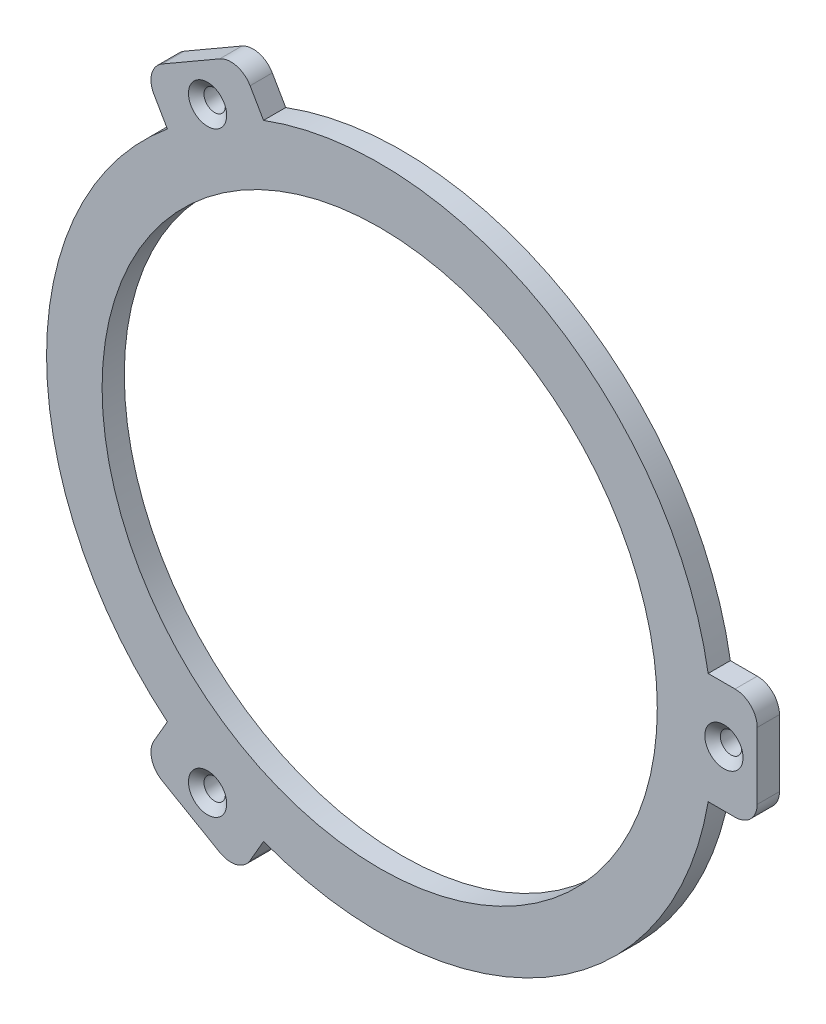
ISO-10303-21;
HEADER;
FILE_DESCRIPTION(('STEP AP214'),'2;1');
FILE_NAME('part.step','',(''),(''),'','','');
FILE_SCHEMA(('AUTOMOTIVE_DESIGN { 1 0 10303 214 1 1 1 1 }'));
ENDSEC;
DATA;
#1=APPLICATION_CONTEXT('core data for automotive mechanical design processes');
#2=APPLICATION_PROTOCOL_DEFINITION('international standard','automotive_design',2000,#1);
#3=PRODUCT_CONTEXT('',#1,'mechanical');
#4=PRODUCT('Part','Part','',(#3));
#5=PRODUCT_RELATED_PRODUCT_CATEGORY('part','',(#4));
#6=PRODUCT_DEFINITION_FORMATION('','',#4);
#7=PRODUCT_DEFINITION_CONTEXT('part definition',#1,'design');
#8=PRODUCT_DEFINITION('design','',#6,#7);
#9=PRODUCT_DEFINITION_SHAPE('','',#8);
#10=(LENGTH_UNIT() NAMED_UNIT(*) SI_UNIT(.MILLI.,.METRE.));
#11=(NAMED_UNIT(*) PLANE_ANGLE_UNIT() SI_UNIT($,.RADIAN.));
#12=(NAMED_UNIT(*) SI_UNIT($,.STERADIAN.) SOLID_ANGLE_UNIT());
#13=UNCERTAINTY_MEASURE_WITH_UNIT(LENGTH_MEASURE(1.E-05),#10,'distance_accuracy_value','');
#14=(GEOMETRIC_REPRESENTATION_CONTEXT(3) GLOBAL_UNCERTAINTY_ASSIGNED_CONTEXT((#13)) GLOBAL_UNIT_ASSIGNED_CONTEXT((#10,
#11,#12)) REPRESENTATION_CONTEXT('',''));
#15=CARTESIAN_POINT('',(0.,0.,0.));
#16=DIRECTION('',(0.,0.,1.));
#17=DIRECTION('',(1.,0.,0.));
#18=AXIS2_PLACEMENT_3D('',#15,#16,#17);
#19=CARTESIAN_POINT('',(0.,0.,0.));
#20=DIRECTION('',(0.,0.,1.));
#21=DIRECTION('',(1.,0.,0.));
#22=AXIS2_PLACEMENT_3D('',#19,#20,#21);
#23=PLANE('',#22);
#24=CARTESIAN_POINT('',(0.,0.,0.));
#25=DIRECTION('',(0.,0.,1.));
#26=DIRECTION('',(1.,0.,0.));
#27=AXIS2_PLACEMENT_3D('',#24,#25,#26);
#28=CIRCLE('',#27,31.75);
#29=CARTESIAN_POINT('',(31.75,0.,0.));
#30=VERTEX_POINT('',#29);
#31=EDGE_CURVE('E234',#30,#30,#28,.T.);
#32=ORIENTED_EDGE('',*,*,#31,.T.);
#33=EDGE_LOOP('',(#32));
#34=FACE_BOUND('',#33,.T.);
#35=CARTESIAN_POINT('',(0.,0.,0.));
#36=DIRECTION('',(0.,0.,-1.));
#37=DIRECTION('',(-1.,0.,0.));
#38=AXIS2_PLACEMENT_3D('',#35,#36,#37);
#39=CIRCLE('',#38,34.544);
#40=CARTESIAN_POINT('',(-34.544,0.,0.));
#41=VERTEX_POINT('',#40);
#42=EDGE_CURVE('E348',#41,#41,#39,.T.);
#43=ORIENTED_EDGE('',*,*,#42,.T.);
#44=EDGE_LOOP('',(#43));
#45=FACE_BOUND('',#44,.T.);
#46=ADVANCED_FACE('F35',(#34,#45),#23,.F.);
#47=CARTESIAN_POINT('',(0.,0.,2.54));
#48=DIRECTION('',(0.,0.,-1.));
#49=DIRECTION('',(-1.,0.,0.));
#50=AXIS2_PLACEMENT_3D('',#47,#48,#49);
#51=CYLINDRICAL_SURFACE('',#50,38.1);
#52=DIRECTION('',(0.,0.,-1.));
#53=VECTOR('',#52,1.);
#54=CARTESIAN_POINT('',(-24.2828146253722,29.359068681922,2.54));
#55=LINE('',#54,#53);
#56=CARTESIAN_POINT('',(-24.2828146253722,29.359068681922,0.));
#57=VERTEX_POINT('',#56);
#58=CARTESIAN_POINT('',(-24.2828146253722,29.359068681922,2.54));
#59=VERTEX_POINT('',#58);
#60=EDGE_CURVE('E167',#57,#59,#55,.F.);
#61=ORIENTED_EDGE('',*,*,#60,.F.);
#62=CARTESIAN_POINT('',(0.,0.,0.));
#63=DIRECTION('',(0.,0.,1.));
#64=DIRECTION('',(1.,0.,0.));
#65=AXIS2_PLACEMENT_3D('',#62,#63,#64);
#66=CIRCLE('',#65,38.1);
#67=CARTESIAN_POINT('',(-24.2828146253726,-29.3590686819216,0.));
#68=VERTEX_POINT('',#67);
#69=EDGE_CURVE('E174',#57,#68,#66,.T.);
#70=ORIENTED_EDGE('',*,*,#69,.T.);
#71=DIRECTION('',(0.,0.,-1.));
#72=VECTOR('',#71,1.);
#73=CARTESIAN_POINT('',(-24.2828146253726,-29.3590686819216,2.54));
#74=LINE('',#73,#72);
#75=CARTESIAN_POINT('',(-24.2828146253726,-29.3590686819216,2.54));
#76=VERTEX_POINT('',#75);
#77=EDGE_CURVE('E207',#76,#68,#74,.T.);
#78=ORIENTED_EDGE('',*,*,#77,.F.);
#79=CARTESIAN_POINT('',(0.,0.,2.54));
#80=DIRECTION('',(0.,0.,1.));
#81=DIRECTION('',(1.,0.,0.));
#82=AXIS2_PLACEMENT_3D('',#79,#80,#81);
#83=CIRCLE('',#82,38.1);
#84=EDGE_CURVE('E188',#59,#76,#83,.T.);
#85=ORIENTED_EDGE('',*,*,#84,.F.);
#86=EDGE_LOOP('',(#61,#70,#78,#85));
#87=FACE_BOUND('',#86,.T.);
#88=ADVANCED_FACE('F187',(#87),#51,.T.);
#89=DIRECTION('',(0.,0.,-1.));
#90=VECTOR('',#89,1.);
#91=CARTESIAN_POINT('',(-13.2842919973098,35.7090686819218,2.54));
#92=LINE('',#91,#90);
#93=CARTESIAN_POINT('',(-13.2842919973098,35.7090686819218,2.54));
#94=VERTEX_POINT('',#93);
#95=CARTESIAN_POINT('',(-13.2842919973098,35.7090686819218,0.));
#96=VERTEX_POINT('',#95);
#97=EDGE_CURVE('E190',#94,#96,#92,.T.);
#98=ORIENTED_EDGE('',*,*,#97,.F.);
#99=CARTESIAN_POINT('',(37.5671066226826,6.35,2.54));
#100=VERTEX_POINT('',#99);
#101=EDGE_CURVE('E246',#100,#94,#83,.T.);
#102=ORIENTED_EDGE('',*,*,#101,.F.);
#103=DIRECTION('',(0.,0.,-1.));
#104=VECTOR('',#103,1.);
#105=CARTESIAN_POINT('',(37.5671066226826,6.35,2.54));
#106=LINE('',#105,#104);
#107=CARTESIAN_POINT('',(37.5671066226826,6.35,0.));
#108=VERTEX_POINT('',#107);
#109=EDGE_CURVE('E253',#108,#100,#106,.F.);
#110=ORIENTED_EDGE('',*,*,#109,.F.);
#111=EDGE_CURVE('E183',#108,#96,#66,.T.);
#112=ORIENTED_EDGE('',*,*,#111,.T.);
#113=EDGE_LOOP('',(#98,#102,#110,#112));
#114=FACE_BOUND('',#113,.T.);
#115=ADVANCED_FACE('F398',(#114),#51,.T.);
#116=DIRECTION('',(0.,0.,-1.));
#117=VECTOR('',#116,1.);
#118=CARTESIAN_POINT('',(-13.2842919973103,-35.7090686819217,2.54));
#119=LINE('',#118,#117);
#120=CARTESIAN_POINT('',(-13.2842919973103,-35.7090686819217,0.));
#121=VERTEX_POINT('',#120);
#122=CARTESIAN_POINT('',(-13.2842919973103,-35.7090686819217,2.54));
#123=VERTEX_POINT('',#122);
#124=EDGE_CURVE('E212',#121,#123,#119,.F.);
#125=ORIENTED_EDGE('',*,*,#124,.F.);
#126=CARTESIAN_POINT('',(37.5671066226826,-6.35,0.));
#127=VERTEX_POINT('',#126);
#128=EDGE_CURVE('E184',#121,#127,#66,.T.);
#129=ORIENTED_EDGE('',*,*,#128,.T.);
#130=DIRECTION('',(0.,0.,-1.));
#131=VECTOR('',#130,1.);
#132=CARTESIAN_POINT('',(37.5671066226826,-6.34999999999999,2.54));
#133=LINE('',#132,#131);
#134=CARTESIAN_POINT('',(37.5671066226826,-6.35,2.54));
#135=VERTEX_POINT('',#134);
#136=EDGE_CURVE('E248',#135,#127,#133,.T.);
#137=ORIENTED_EDGE('',*,*,#136,.F.);
#138=EDGE_CURVE('E249',#123,#135,#83,.T.);
#139=ORIENTED_EDGE('',*,*,#138,.F.);
#140=EDGE_LOOP('',(#125,#129,#137,#139));
#141=FACE_BOUND('',#140,.T.);
#142=ADVANCED_FACE('F392',(#141),#51,.T.);
#143=CARTESIAN_POINT('',(0.,0.,2.54));
#144=DIRECTION('',(0.,0.,1.));
#145=DIRECTION('',(1.,0.,0.));
#146=AXIS2_PLACEMENT_3D('',#143,#144,#145);
#147=PLANE('',#146);
#148=CARTESIAN_POINT('',(-19.6849999999997,34.0954201469935,2.54));
#149=DIRECTION('',(0.,0.,1.));
#150=DIRECTION('',(1.,0.,0.));
#151=AXIS2_PLACEMENT_3D('',#148,#149,#150);
#152=CIRCLE('',#151,2.1844);
#153=CARTESIAN_POINT('',(-17.5005999999997,34.0954201469935,2.54));
#154=VERTEX_POINT('',#153);
#155=EDGE_CURVE('E338',#154,#154,#152,.T.);
#156=ORIENTED_EDGE('',*,*,#155,.F.);
#157=EDGE_LOOP('',(#156));
#158=FACE_BOUND('',#157,.T.);
#159=CARTESIAN_POINT('',(-19.6850000000002,-34.0954201469933,2.54));
#160=DIRECTION('',(0.,0.,1.));
#161=DIRECTION('',(1.,0.,0.));
#162=AXIS2_PLACEMENT_3D('',#159,#160,#161);
#163=CIRCLE('',#162,2.1844);
#164=CARTESIAN_POINT('',(-17.5006000000002,-34.0954201469933,2.54));
#165=VERTEX_POINT('',#164);
#166=EDGE_CURVE('E329',#165,#165,#163,.T.);
#167=ORIENTED_EDGE('',*,*,#166,.F.);
#168=EDGE_LOOP('',(#167));
#169=FACE_BOUND('',#168,.T.);
#170=DIRECTION('',(-0.499999999999992,0.866025403784443,0.));
#171=VECTOR('',#170,1.);
#172=CARTESIAN_POINT('',(-16.0907386859684,40.5699769354122,2.54));
#173=LINE('',#172,#171);
#174=CARTESIAN_POINT('',(-14.8207386859685,38.3702724097997,2.54));
#175=VERTEX_POINT('',#174);
#176=EDGE_CURVE('E196',#94,#175,#173,.T.);
#177=ORIENTED_EDGE('',*,*,#176,.T.);
#178=CARTESIAN_POINT('',(-17.020443211581,37.1002724097997,2.54));
#179=DIRECTION('',(0.,0.,1.));
#180=DIRECTION('',(1.,0.,0.));
#181=AXIS2_PLACEMENT_3D('',#178,#179,#180);
#182=CIRCLE('',#181,2.54);
#183=CARTESIAN_POINT('',(-18.2904432115809,39.2999769354122,2.54));
#184=VERTEX_POINT('',#183);
#185=EDGE_CURVE('E43',#175,#184,#182,.T.);
#186=ORIENTED_EDGE('',*,*,#185,.T.);
#187=DIRECTION('',(-0.866025403784443,-0.499999999999992,0.));
#188=VECTOR('',#187,1.);
#189=CARTESIAN_POINT('',(-27.0892613140309,34.2199769354123,2.54));
#190=LINE('',#189,#188);
#191=CARTESIAN_POINT('',(-24.8895567884184,35.4899769354123,2.54));
#192=VERTEX_POINT('',#191);
#193=EDGE_CURVE('E306',#184,#192,#190,.T.);
#194=ORIENTED_EDGE('',*,*,#193,.T.);
#195=CARTESIAN_POINT('',(-23.6195567884184,33.2902724097998,2.54));
#196=DIRECTION('',(0.,0.,1.));
#197=DIRECTION('',(1.,0.,0.));
#198=AXIS2_PLACEMENT_3D('',#195,#196,#197);
#199=CIRCLE('',#198,2.54);
#200=CARTESIAN_POINT('',(-25.8192613140309,32.0202724097998,2.54));
#201=VERTEX_POINT('',#200);
#202=EDGE_CURVE('E50',#192,#201,#199,.T.);
#203=ORIENTED_EDGE('',*,*,#202,.T.);
#204=DIRECTION('',(0.499999999999992,-0.866025403784443,0.));
#205=VECTOR('',#204,1.);
#206=CARTESIAN_POINT('',(-27.0892613140309,34.2199769354123,2.54));
#207=LINE('',#206,#205);
#208=EDGE_CURVE('E313',#201,#59,#207,.T.);
#209=ORIENTED_EDGE('',*,*,#208,.T.);
#210=ORIENTED_EDGE('',*,*,#84,.T.);
#211=DIRECTION('',(-0.500000000000004,-0.866025403784436,0.));
#212=VECTOR('',#211,1.);
#213=CARTESIAN_POINT('',(-27.0892613140313,-34.2199769354119,2.54));
#214=LINE('',#213,#212);
#215=CARTESIAN_POINT('',(-25.8192613140313,-32.0202724097995,2.54));
#216=VERTEX_POINT('',#215);
#217=EDGE_CURVE('E205',#76,#216,#214,.T.);
#218=ORIENTED_EDGE('',*,*,#217,.T.);
#219=CARTESIAN_POINT('',(-23.6195567884189,-33.2902724097995,2.54));
#220=DIRECTION('',(0.,0.,1.));
#221=DIRECTION('',(1.,0.,0.));
#222=AXIS2_PLACEMENT_3D('',#219,#220,#221);
#223=CIRCLE('',#222,2.54);
#224=CARTESIAN_POINT('',(-24.8895567884189,-35.4899769354119,2.54));
#225=VERTEX_POINT('',#224);
#226=EDGE_CURVE('E287',#216,#225,#223,.T.);
#227=ORIENTED_EDGE('',*,*,#226,.T.);
#228=DIRECTION('',(0.866025403784436,-0.500000000000004,0.));
#229=VECTOR('',#228,1.);
#230=CARTESIAN_POINT('',(-16.090738685969,-40.569976935412,2.54));
#231=LINE('',#230,#229);
#232=CARTESIAN_POINT('',(-18.2904432115815,-39.299976935412,2.54));
#233=VERTEX_POINT('',#232);
#234=EDGE_CURVE('E200',#225,#233,#231,.T.);
#235=ORIENTED_EDGE('',*,*,#234,.T.);
#236=CARTESIAN_POINT('',(-17.0204432115815,-37.1002724097995,2.54));
#237=DIRECTION('',(0.,0.,1.));
#238=DIRECTION('',(1.,0.,0.));
#239=AXIS2_PLACEMENT_3D('',#236,#237,#238);
#240=CIRCLE('',#239,2.54);
#241=CARTESIAN_POINT('',(-14.820738685969,-38.3702724097995,2.54));
#242=VERTEX_POINT('',#241);
#243=EDGE_CURVE('E285',#233,#242,#240,.T.);
#244=ORIENTED_EDGE('',*,*,#243,.T.);
#245=DIRECTION('',(0.500000000000004,0.866025403784436,0.));
#246=VECTOR('',#245,1.);
#247=CARTESIAN_POINT('',(-16.090738685969,-40.569976935412,2.54));
#248=LINE('',#247,#246);
#249=EDGE_CURVE('E203',#242,#123,#248,.T.);
#250=ORIENTED_EDGE('',*,*,#249,.T.);
#251=ORIENTED_EDGE('',*,*,#138,.T.);
#252=DIRECTION('',(1.,0.,0.));
#253=VECTOR('',#252,1.);
#254=CARTESIAN_POINT('',(43.18,-6.34999999999999,2.54));
#255=LINE('',#254,#253);
#256=CARTESIAN_POINT('',(40.64,-6.34999999999999,2.54));
#257=VERTEX_POINT('',#256);
#258=EDGE_CURVE('E231',#135,#257,#255,.T.);
#259=ORIENTED_EDGE('',*,*,#258,.T.);
#260=CARTESIAN_POINT('',(40.64,-3.80999999999999,2.54));
#261=DIRECTION('',(0.,0.,1.));
#262=DIRECTION('',(1.,0.,0.));
#263=AXIS2_PLACEMENT_3D('',#260,#261,#262);
#264=CIRCLE('',#263,2.54);
#265=CARTESIAN_POINT('',(43.18,-3.80999999999999,2.54));
#266=VERTEX_POINT('',#265);
#267=EDGE_CURVE('E269',#257,#266,#264,.T.);
#268=ORIENTED_EDGE('',*,*,#267,.T.);
#269=DIRECTION('',(0.,1.,0.));
#270=VECTOR('',#269,1.);
#271=CARTESIAN_POINT('',(43.18,6.35,2.54));
#272=LINE('',#271,#270);
#273=CARTESIAN_POINT('',(43.18,3.81,2.54));
#274=VERTEX_POINT('',#273);
#275=EDGE_CURVE('E225',#266,#274,#272,.T.);
#276=ORIENTED_EDGE('',*,*,#275,.T.);
#277=CARTESIAN_POINT('',(40.64,3.81,2.54));
#278=DIRECTION('',(0.,0.,1.));
#279=DIRECTION('',(1.,0.,0.));
#280=AXIS2_PLACEMENT_3D('',#277,#278,#279);
#281=CIRCLE('',#280,2.54);
#282=CARTESIAN_POINT('',(40.64,6.35,2.54));
#283=VERTEX_POINT('',#282);
#284=EDGE_CURVE('E267',#274,#283,#281,.T.);
#285=ORIENTED_EDGE('',*,*,#284,.T.);
#286=DIRECTION('',(-1.,0.,0.));
#287=VECTOR('',#286,1.);
#288=CARTESIAN_POINT('',(43.18,6.35,2.54));
#289=LINE('',#288,#287);
#290=EDGE_CURVE('E228',#283,#100,#289,.T.);
#291=ORIENTED_EDGE('',*,*,#290,.T.);
#292=ORIENTED_EDGE('',*,*,#101,.T.);
#293=EDGE_LOOP('',(#177,#186,#194,#203,#209,#210,#218,#227,#235,#244,#250,#251,#259,#268,#276,
#285,#291,#292));
#294=FACE_BOUND('',#293,.T.);
#295=CARTESIAN_POINT('',(39.37,0.,2.54));
#296=DIRECTION('',(0.,0.,1.));
#297=DIRECTION('',(1.,0.,0.));
#298=AXIS2_PLACEMENT_3D('',#295,#296,#297);
#299=CIRCLE('',#298,2.1844);
#300=CARTESIAN_POINT('',(41.5544,0.,2.54));
#301=VERTEX_POINT('',#300);
#302=EDGE_CURVE('E215',#301,#301,#299,.T.);
#303=ORIENTED_EDGE('',*,*,#302,.F.);
#304=EDGE_LOOP('',(#303));
#305=FACE_BOUND('',#304,.T.);
#306=CARTESIAN_POINT('',(0.,0.,2.54));
#307=DIRECTION('',(0.,0.,1.));
#308=DIRECTION('',(1.,0.,0.));
#309=AXIS2_PLACEMENT_3D('',#306,#307,#308);
#310=CIRCLE('',#309,31.75);
#311=CARTESIAN_POINT('',(31.75,0.,2.54));
#312=VERTEX_POINT('',#311);
#313=EDGE_CURVE('E241',#312,#312,#310,.T.);
#314=ORIENTED_EDGE('',*,*,#313,.F.);
#315=EDGE_LOOP('',(#314));
#316=FACE_BOUND('',#315,.T.);
#317=ADVANCED_FACE('F304',(#158,#169,#294,#305,#316),#147,.T.);
#318=CARTESIAN_POINT('',(0.,0.,0.));
#319=DIRECTION('',(0.,0.,-1.));
#320=DIRECTION('',(-1.,0.,0.));
#321=AXIS2_PLACEMENT_3D('',#318,#319,#320);
#322=CIRCLE('',#321,36.9697);
#323=CARTESIAN_POINT('',(-36.9697,0.,0.));
#324=VERTEX_POINT('',#323);
#325=EDGE_CURVE('E342',#324,#324,#322,.T.);
#326=ORIENTED_EDGE('',*,*,#325,.F.);
#327=EDGE_LOOP('',(#326));
#328=FACE_BOUND('',#327,.T.);
#329=CARTESIAN_POINT('',(-19.6849999999997,34.0954201469935,0.));
#330=DIRECTION('',(0.,0.,1.));
#331=DIRECTION('',(1.,0.,0.));
#332=AXIS2_PLACEMENT_3D('',#329,#330,#331);
#333=CIRCLE('',#332,1.2192);
#334=CARTESIAN_POINT('',(-18.4657999999997,34.0954201469935,0.));
#335=VERTEX_POINT('',#334);
#336=EDGE_CURVE('E332',#335,#335,#333,.T.);
#337=ORIENTED_EDGE('',*,*,#336,.T.);
#338=EDGE_LOOP('',(#337));
#339=FACE_BOUND('',#338,.T.);
#340=CARTESIAN_POINT('',(-19.6850000000002,-34.0954201469933,0.));
#341=DIRECTION('',(0.,0.,1.));
#342=DIRECTION('',(1.,0.,0.));
#343=AXIS2_PLACEMENT_3D('',#340,#341,#342);
#344=CIRCLE('',#343,1.2192);
#345=CARTESIAN_POINT('',(-18.4658000000002,-34.0954201469933,0.));
#346=VERTEX_POINT('',#345);
#347=EDGE_CURVE('E321',#346,#346,#344,.T.);
#348=ORIENTED_EDGE('',*,*,#347,.T.);
#349=EDGE_LOOP('',(#348));
#350=FACE_BOUND('',#349,.T.);
#351=DIRECTION('',(-0.866025403784443,-0.499999999999992,0.));
#352=VECTOR('',#351,1.);
#353=CARTESIAN_POINT('',(-27.0892613140309,34.2199769354123,0.));
#354=LINE('',#353,#352);
#355=CARTESIAN_POINT('',(-18.2904432115809,39.2999769354122,0.));
#356=VERTEX_POINT('',#355);
#357=CARTESIAN_POINT('',(-24.8895567884184,35.4899769354123,0.));
#358=VERTEX_POINT('',#357);
#359=EDGE_CURVE('E171',#356,#358,#354,.T.);
#360=ORIENTED_EDGE('',*,*,#359,.F.);
#361=CARTESIAN_POINT('',(-17.020443211581,37.1002724097997,0.));
#362=DIRECTION('',(0.,0.,1.));
#363=DIRECTION('',(1.,0.,0.));
#364=AXIS2_PLACEMENT_3D('',#361,#362,#363);
#365=CIRCLE('',#364,2.54);
#366=CARTESIAN_POINT('',(-14.8207386859685,38.3702724097997,0.));
#367=VERTEX_POINT('',#366);
#368=EDGE_CURVE('E299',#356,#367,#365,.F.);
#369=ORIENTED_EDGE('',*,*,#368,.T.);
#370=DIRECTION('',(-0.499999999999992,0.866025403784443,0.));
#371=VECTOR('',#370,1.);
#372=CARTESIAN_POINT('',(-16.0907386859684,40.5699769354122,0.));
#373=LINE('',#372,#371);
#374=EDGE_CURVE('E170',#96,#367,#373,.T.);
#375=ORIENTED_EDGE('',*,*,#374,.F.);
#376=ORIENTED_EDGE('',*,*,#111,.F.);
#377=DIRECTION('',(-1.,0.,0.));
#378=VECTOR('',#377,1.);
#379=CARTESIAN_POINT('',(43.18,6.35,0.));
#380=LINE('',#379,#378);
#381=CARTESIAN_POINT('',(40.64,6.35,0.));
#382=VERTEX_POINT('',#381);
#383=EDGE_CURVE('E237',#382,#108,#380,.T.);
#384=ORIENTED_EDGE('',*,*,#383,.F.);
#385=CARTESIAN_POINT('',(40.64,3.81,0.));
#386=DIRECTION('',(0.,0.,1.));
#387=DIRECTION('',(1.,0.,0.));
#388=AXIS2_PLACEMENT_3D('',#385,#386,#387);
#389=CIRCLE('',#388,2.54);
#390=CARTESIAN_POINT('',(43.18,3.81,0.));
#391=VERTEX_POINT('',#390);
#392=EDGE_CURVE('E261',#382,#391,#389,.F.);
#393=ORIENTED_EDGE('',*,*,#392,.T.);
#394=DIRECTION('',(0.,1.,0.));
#395=VECTOR('',#394,1.);
#396=CARTESIAN_POINT('',(43.18,6.35,0.));
#397=LINE('',#396,#395);
#398=CARTESIAN_POINT('',(43.18,-3.80999999999999,0.));
#399=VERTEX_POINT('',#398);
#400=EDGE_CURVE('E224',#399,#391,#397,.T.);
#401=ORIENTED_EDGE('',*,*,#400,.F.);
#402=CARTESIAN_POINT('',(40.64,-3.80999999999999,0.));
#403=DIRECTION('',(0.,0.,1.));
#404=DIRECTION('',(1.,0.,0.));
#405=AXIS2_PLACEMENT_3D('',#402,#403,#404);
#406=CIRCLE('',#405,2.54);
#407=CARTESIAN_POINT('',(40.64,-6.34999999999999,0.));
#408=VERTEX_POINT('',#407);
#409=EDGE_CURVE('E263',#399,#408,#406,.F.);
#410=ORIENTED_EDGE('',*,*,#409,.T.);
#411=DIRECTION('',(1.,0.,0.));
#412=VECTOR('',#411,1.);
#413=CARTESIAN_POINT('',(43.18,-6.34999999999999,0.));
#414=LINE('',#413,#412);
#415=EDGE_CURVE('E229',#127,#408,#414,.T.);
#416=ORIENTED_EDGE('',*,*,#415,.F.);
#417=ORIENTED_EDGE('',*,*,#128,.F.);
#418=DIRECTION('',(0.500000000000004,0.866025403784436,0.));
#419=VECTOR('',#418,1.);
#420=CARTESIAN_POINT('',(-16.090738685969,-40.569976935412,0.));
#421=LINE('',#420,#419);
#422=CARTESIAN_POINT('',(-14.820738685969,-38.3702724097995,0.));
#423=VERTEX_POINT('',#422);
#424=EDGE_CURVE('E193',#423,#121,#421,.T.);
#425=ORIENTED_EDGE('',*,*,#424,.F.);
#426=CARTESIAN_POINT('',(-17.0204432115815,-37.1002724097995,0.));
#427=DIRECTION('',(0.,0.,1.));
#428=DIRECTION('',(1.,0.,0.));
#429=AXIS2_PLACEMENT_3D('',#426,#427,#428);
#430=CIRCLE('',#429,2.54);
#431=CARTESIAN_POINT('',(-18.2904432115815,-39.299976935412,0.));
#432=VERTEX_POINT('',#431);
#433=EDGE_CURVE('E279',#423,#432,#430,.F.);
#434=ORIENTED_EDGE('',*,*,#433,.T.);
#435=DIRECTION('',(0.866025403784436,-0.500000000000004,0.));
#436=VECTOR('',#435,1.);
#437=CARTESIAN_POINT('',(-16.090738685969,-40.569976935412,0.));
#438=LINE('',#437,#436);
#439=CARTESIAN_POINT('',(-24.8895567884189,-35.4899769354119,0.));
#440=VERTEX_POINT('',#439);
#441=EDGE_CURVE('E189',#440,#432,#438,.T.);
#442=ORIENTED_EDGE('',*,*,#441,.F.);
#443=CARTESIAN_POINT('',(-23.6195567884189,-33.2902724097995,0.));
#444=DIRECTION('',(0.,0.,1.));
#445=DIRECTION('',(1.,0.,0.));
#446=AXIS2_PLACEMENT_3D('',#443,#444,#445);
#447=CIRCLE('',#446,2.54);
#448=CARTESIAN_POINT('',(-25.8192613140313,-32.0202724097995,0.));
#449=VERTEX_POINT('',#448);
#450=EDGE_CURVE('E281',#440,#449,#447,.F.);
#451=ORIENTED_EDGE('',*,*,#450,.T.);
#452=DIRECTION('',(-0.500000000000004,-0.866025403784436,0.));
#453=VECTOR('',#452,1.);
#454=CARTESIAN_POINT('',(-27.0892613140313,-34.2199769354119,0.));
#455=LINE('',#454,#453);
#456=EDGE_CURVE('E179',#68,#449,#455,.T.);
#457=ORIENTED_EDGE('',*,*,#456,.F.);
#458=ORIENTED_EDGE('',*,*,#69,.F.);
#459=DIRECTION('',(0.499999999999992,-0.866025403784443,0.));
#460=VECTOR('',#459,1.);
#461=CARTESIAN_POINT('',(-27.0892613140309,34.2199769354123,0.));
#462=LINE('',#461,#460);
#463=CARTESIAN_POINT('',(-25.8192613140309,32.0202724097998,0.));
#464=VERTEX_POINT('',#463);
#465=EDGE_CURVE('E163',#464,#57,#462,.T.);
#466=ORIENTED_EDGE('',*,*,#465,.F.);
#467=CARTESIAN_POINT('',(-23.6195567884184,33.2902724097998,0.));
#468=DIRECTION('',(0.,0.,1.));
#469=DIRECTION('',(1.,0.,0.));
#470=AXIS2_PLACEMENT_3D('',#467,#468,#469);
#471=CIRCLE('',#470,2.54);
#472=EDGE_CURVE('E297',#464,#358,#471,.F.);
#473=ORIENTED_EDGE('',*,*,#472,.T.);
#474=EDGE_LOOP('',(#360,#369,#375,#376,#384,#393,#401,#410,#416,#417,#425,#434,#442,#451,#457,
#458,#466,#473));
#475=FACE_BOUND('',#474,.T.);
#476=CARTESIAN_POINT('',(39.37,0.,0.));
#477=DIRECTION('',(0.,0.,1.));
#478=DIRECTION('',(1.,0.,0.));
#479=AXIS2_PLACEMENT_3D('',#476,#477,#478);
#480=CIRCLE('',#479,1.2192);
#481=CARTESIAN_POINT('',(40.5892,0.,0.));
#482=VERTEX_POINT('',#481);
#483=EDGE_CURVE('E221',#482,#482,#480,.T.);
#484=ORIENTED_EDGE('',*,*,#483,.T.);
#485=EDGE_LOOP('',(#484));
#486=FACE_BOUND('',#485,.T.);
#487=ADVANCED_FACE('F176',(#328,#339,#350,#475,#486),#23,.F.);
#488=CARTESIAN_POINT('',(0.,0.,2.54));
#489=DIRECTION('',(0.,0.,-1.));
#490=DIRECTION('',(-1.,0.,0.));
#491=AXIS2_PLACEMENT_3D('',#488,#489,#490);
#492=CYLINDRICAL_SURFACE('',#491,31.75);
#493=ORIENTED_EDGE('',*,*,#313,.T.);
#494=EDGE_LOOP('',(#493));
#495=FACE_BOUND('',#494,.T.);
#496=ORIENTED_EDGE('',*,*,#31,.F.);
#497=EDGE_LOOP('',(#496));
#498=FACE_BOUND('',#497,.T.);
#499=ADVANCED_FACE('F372',(#495,#498),#492,.F.);
#500=CARTESIAN_POINT('',(43.18,6.35,2.54));
#501=DIRECTION('',(0.,-1.,0.));
#502=DIRECTION('',(1.,0.,0.));
#503=AXIS2_PLACEMENT_3D('',#500,#501,#502);
#504=PLANE('',#503);
#505=ORIENTED_EDGE('',*,*,#290,.F.);
#506=DIRECTION('',(0.,0.,-1.));
#507=VECTOR('',#506,1.);
#508=CARTESIAN_POINT('',(40.64,6.35,2.54));
#509=LINE('',#508,#507);
#510=EDGE_CURVE('E271',#283,#382,#509,.T.);
#511=ORIENTED_EDGE('',*,*,#510,.T.);
#512=ORIENTED_EDGE('',*,*,#383,.T.);
#513=ORIENTED_EDGE('',*,*,#109,.T.);
#514=EDGE_LOOP('',(#505,#511,#512,#513));
#515=FACE_BOUND('',#514,.T.);
#516=ADVANCED_FACE('F499',(#515),#504,.F.);
#517=CARTESIAN_POINT('',(43.18,-6.34999999999999,2.54));
#518=DIRECTION('',(0.,1.,0.));
#519=DIRECTION('',(-1.,0.,0.));
#520=AXIS2_PLACEMENT_3D('',#517,#518,#519);
#521=PLANE('',#520);
#522=ORIENTED_EDGE('',*,*,#415,.T.);
#523=DIRECTION('',(0.,0.,-1.));
#524=VECTOR('',#523,1.);
#525=CARTESIAN_POINT('',(40.64,-6.34999999999999,2.54));
#526=LINE('',#525,#524);
#527=EDGE_CURVE('E265',#408,#257,#526,.F.);
#528=ORIENTED_EDGE('',*,*,#527,.T.);
#529=ORIENTED_EDGE('',*,*,#258,.F.);
#530=ORIENTED_EDGE('',*,*,#136,.T.);
#531=EDGE_LOOP('',(#522,#528,#529,#530));
#532=FACE_BOUND('',#531,.T.);
#533=ADVANCED_FACE('F506',(#532),#521,.F.);
#534=CARTESIAN_POINT('',(43.18,6.35,2.54));
#535=DIRECTION('',(-1.,0.,0.));
#536=DIRECTION('',(0.,0.,1.));
#537=AXIS2_PLACEMENT_3D('',#534,#535,#536);
#538=PLANE('',#537);
#539=ORIENTED_EDGE('',*,*,#275,.F.);
#540=DIRECTION('',(0.,0.,-1.));
#541=VECTOR('',#540,1.);
#542=CARTESIAN_POINT('',(43.18,-3.80999999999999,2.54));
#543=LINE('',#542,#541);
#544=EDGE_CURVE('E258',#266,#399,#543,.T.);
#545=ORIENTED_EDGE('',*,*,#544,.T.);
#546=ORIENTED_EDGE('',*,*,#400,.T.);
#547=DIRECTION('',(0.,0.,-1.));
#548=VECTOR('',#547,1.);
#549=CARTESIAN_POINT('',(43.18,3.81,2.54));
#550=LINE('',#549,#548);
#551=EDGE_CURVE('E256',#391,#274,#550,.F.);
#552=ORIENTED_EDGE('',*,*,#551,.T.);
#553=EDGE_LOOP('',(#539,#545,#546,#552));
#554=FACE_BOUND('',#553,.T.);
#555=ADVANCED_FACE('F414',(#554),#538,.F.);
#556=CARTESIAN_POINT('',(40.64,-3.80999999999999,2.54));
#557=DIRECTION('',(0.,0.,-1.));
#558=DIRECTION('',(-1.,0.,0.));
#559=AXIS2_PLACEMENT_3D('',#556,#557,#558);
#560=CYLINDRICAL_SURFACE('',#559,2.54);
#561=ORIENTED_EDGE('',*,*,#267,.F.);
#562=ORIENTED_EDGE('',*,*,#527,.F.);
#563=ORIENTED_EDGE('',*,*,#409,.F.);
#564=ORIENTED_EDGE('',*,*,#544,.F.);
#565=EDGE_LOOP('',(#561,#562,#563,#564));
#566=FACE_BOUND('',#565,.T.);
#567=ADVANCED_FACE('F410',(#566),#560,.T.);
#568=CARTESIAN_POINT('',(40.64,3.81,2.54));
#569=DIRECTION('',(0.,0.,-1.));
#570=DIRECTION('',(-1.,0.,0.));
#571=AXIS2_PLACEMENT_3D('',#568,#569,#570);
#572=CYLINDRICAL_SURFACE('',#571,2.54);
#573=ORIENTED_EDGE('',*,*,#284,.F.);
#574=ORIENTED_EDGE('',*,*,#551,.F.);
#575=ORIENTED_EDGE('',*,*,#392,.F.);
#576=ORIENTED_EDGE('',*,*,#510,.F.);
#577=EDGE_LOOP('',(#573,#574,#575,#576));
#578=FACE_BOUND('',#577,.T.);
#579=ADVANCED_FACE('F413',(#578),#572,.T.);
#580=CARTESIAN_POINT('',(39.37,0.,2.54));
#581=DIRECTION('',(0.,0.,1.));
#582=DIRECTION('',(1.,0.,0.));
#583=AXIS2_PLACEMENT_3D('',#580,#581,#582);
#584=CYLINDRICAL_SURFACE('',#583,1.2192);
#585=ORIENTED_EDGE('',*,*,#483,.F.);
#586=EDGE_LOOP('',(#585));
#587=FACE_BOUND('',#586,.T.);
#588=CARTESIAN_POINT('',(39.37,0.,1.73010103598769));
#589=DIRECTION('',(0.,0.,1.));
#590=DIRECTION('',(1.,0.,0.));
#591=AXIS2_PLACEMENT_3D('',#588,#589,#590);
#592=CIRCLE('',#591,1.2192);
#593=CARTESIAN_POINT('',(40.5892,0.,1.73010103598769));
#594=VERTEX_POINT('',#593);
#595=EDGE_CURVE('E218',#594,#594,#592,.T.);
#596=ORIENTED_EDGE('',*,*,#595,.T.);
#597=EDGE_LOOP('',(#596));
#598=FACE_BOUND('',#597,.T.);
#599=ADVANCED_FACE('F418',(#587,#598),#584,.F.);
#600=CARTESIAN_POINT('',(39.37,0.,2.54));
#601=DIRECTION('',(0.,0.,1.));
#602=DIRECTION('',(1.,0.,0.));
#603=AXIS2_PLACEMENT_3D('',#600,#601,#602);
#604=CONICAL_SURFACE('',#603,2.1844,0.872664625997167);
#605=ORIENTED_EDGE('',*,*,#595,.F.);
#606=EDGE_LOOP('',(#605));
#607=FACE_BOUND('',#606,.T.);
#608=ORIENTED_EDGE('',*,*,#302,.T.);
#609=EDGE_LOOP('',(#608));
#610=FACE_BOUND('',#609,.T.);
#611=ADVANCED_FACE('F536',(#607,#610),#604,.F.);
#612=CARTESIAN_POINT('',(-16.090738685969,-40.569976935412,2.54));
#613=DIRECTION('',(-0.866025403784436,0.500000000000004,0.));
#614=DIRECTION('',(-0.500000000000004,-0.866025403784436,0.));
#615=AXIS2_PLACEMENT_3D('',#612,#613,#614);
#616=PLANE('',#615);
#617=ORIENTED_EDGE('',*,*,#249,.F.);
#618=DIRECTION('',(0.,0.,-1.));
#619=VECTOR('',#618,1.);
#620=CARTESIAN_POINT('',(-14.820738685969,-38.3702724097995,2.54));
#621=LINE('',#620,#619);
#622=EDGE_CURVE('E289',#242,#423,#621,.T.);
#623=ORIENTED_EDGE('',*,*,#622,.T.);
#624=ORIENTED_EDGE('',*,*,#424,.T.);
#625=ORIENTED_EDGE('',*,*,#124,.T.);
#626=EDGE_LOOP('',(#617,#623,#624,#625));
#627=FACE_BOUND('',#626,.T.);
#628=ADVANCED_FACE('F544',(#627),#616,.F.);
#629=CARTESIAN_POINT('',(-27.0892613140313,-34.2199769354119,2.54));
#630=DIRECTION('',(0.866025403784436,-0.500000000000004,0.));
#631=DIRECTION('',(0.500000000000004,0.866025403784436,0.));
#632=AXIS2_PLACEMENT_3D('',#629,#630,#631);
#633=PLANE('',#632);
#634=ORIENTED_EDGE('',*,*,#456,.T.);
#635=DIRECTION('',(0.,0.,-1.));
#636=VECTOR('',#635,1.);
#637=CARTESIAN_POINT('',(-25.8192613140313,-32.0202724097995,2.54));
#638=LINE('',#637,#636);
#639=EDGE_CURVE('E283',#449,#216,#638,.F.);
#640=ORIENTED_EDGE('',*,*,#639,.T.);
#641=ORIENTED_EDGE('',*,*,#217,.F.);
#642=ORIENTED_EDGE('',*,*,#77,.T.);
#643=EDGE_LOOP('',(#634,#640,#641,#642));
#644=FACE_BOUND('',#643,.T.);
#645=ADVANCED_FACE('F553',(#644),#633,.F.);
#646=CARTESIAN_POINT('',(-16.090738685969,-40.569976935412,2.54));
#647=DIRECTION('',(0.500000000000004,0.866025403784436,0.));
#648=DIRECTION('',(-0.866025403784436,0.500000000000004,0.));
#649=AXIS2_PLACEMENT_3D('',#646,#647,#648);
#650=PLANE('',#649);
#651=ORIENTED_EDGE('',*,*,#234,.F.);
#652=DIRECTION('',(0.,0.,-1.));
#653=VECTOR('',#652,1.);
#654=CARTESIAN_POINT('',(-24.8895567884189,-35.4899769354119,2.54));
#655=LINE('',#654,#653);
#656=EDGE_CURVE('E276',#225,#440,#655,.T.);
#657=ORIENTED_EDGE('',*,*,#656,.T.);
#658=ORIENTED_EDGE('',*,*,#441,.T.);
#659=DIRECTION('',(0.,0.,-1.));
#660=VECTOR('',#659,1.);
#661=CARTESIAN_POINT('',(-18.2904432115815,-39.299976935412,2.54));
#662=LINE('',#661,#660);
#663=EDGE_CURVE('E274',#432,#233,#662,.F.);
#664=ORIENTED_EDGE('',*,*,#663,.T.);
#665=EDGE_LOOP('',(#651,#657,#658,#664));
#666=FACE_BOUND('',#665,.T.);
#667=ADVANCED_FACE('F560',(#666),#650,.F.);
#668=CARTESIAN_POINT('',(-27.0892613140309,34.2199769354123,2.54));
#669=DIRECTION('',(0.866025403784443,0.499999999999992,0.));
#670=DIRECTION('',(-0.499999999999992,0.866025403784443,0.));
#671=AXIS2_PLACEMENT_3D('',#668,#669,#670);
#672=PLANE('',#671);
#673=ORIENTED_EDGE('',*,*,#208,.F.);
#674=DIRECTION('',(0.,0.,-1.));
#675=VECTOR('',#674,1.);
#676=CARTESIAN_POINT('',(-25.8192613140309,32.0202724097998,2.54));
#677=LINE('',#676,#675);
#678=EDGE_CURVE('E11',#201,#464,#677,.T.);
#679=ORIENTED_EDGE('',*,*,#678,.T.);
#680=ORIENTED_EDGE('',*,*,#465,.T.);
#681=ORIENTED_EDGE('',*,*,#60,.T.);
#682=EDGE_LOOP('',(#673,#679,#680,#681));
#683=FACE_BOUND('',#682,.T.);
#684=ADVANCED_FACE('F165',(#683),#672,.F.);
#685=CARTESIAN_POINT('',(-16.0907386859684,40.5699769354122,2.54));
#686=DIRECTION('',(-0.866025403784443,-0.499999999999992,0.));
#687=DIRECTION('',(0.499999999999992,-0.866025403784443,0.));
#688=AXIS2_PLACEMENT_3D('',#685,#686,#687);
#689=PLANE('',#688);
#690=ORIENTED_EDGE('',*,*,#374,.T.);
#691=DIRECTION('',(0.,0.,-1.));
#692=VECTOR('',#691,1.);
#693=CARTESIAN_POINT('',(-14.8207386859685,38.3702724097997,2.54));
#694=LINE('',#693,#692);
#695=EDGE_CURVE('E58',#367,#175,#694,.F.);
#696=ORIENTED_EDGE('',*,*,#695,.T.);
#697=ORIENTED_EDGE('',*,*,#176,.F.);
#698=ORIENTED_EDGE('',*,*,#97,.T.);
#699=EDGE_LOOP('',(#690,#696,#697,#698));
#700=FACE_BOUND('',#699,.T.);
#701=ADVANCED_FACE('F318',(#700),#689,.F.);
#702=CARTESIAN_POINT('',(-27.0892613140309,34.2199769354123,2.54));
#703=DIRECTION('',(0.499999999999992,-0.866025403784443,0.));
#704=DIRECTION('',(0.866025403784443,0.499999999999992,0.));
#705=AXIS2_PLACEMENT_3D('',#702,#703,#704);
#706=PLANE('',#705);
#707=ORIENTED_EDGE('',*,*,#193,.F.);
#708=DIRECTION('',(0.,0.,-1.));
#709=VECTOR('',#708,1.);
#710=CARTESIAN_POINT('',(-18.2904432115809,39.2999769354122,2.54));
#711=LINE('',#710,#709);
#712=EDGE_CURVE('E294',#184,#356,#711,.T.);
#713=ORIENTED_EDGE('',*,*,#712,.T.);
#714=ORIENTED_EDGE('',*,*,#359,.T.);
#715=DIRECTION('',(0.,0.,-1.));
#716=VECTOR('',#715,1.);
#717=CARTESIAN_POINT('',(-24.8895567884184,35.4899769354123,2.54));
#718=LINE('',#717,#716);
#719=EDGE_CURVE('E292',#358,#192,#718,.F.);
#720=ORIENTED_EDGE('',*,*,#719,.T.);
#721=EDGE_LOOP('',(#707,#713,#714,#720));
#722=FACE_BOUND('',#721,.T.);
#723=ADVANCED_FACE('F310',(#722),#706,.F.);
#724=CARTESIAN_POINT('',(-23.6195567884189,-33.2902724097995,2.54));
#725=DIRECTION('',(0.,0.,-1.));
#726=DIRECTION('',(-1.,0.,0.));
#727=AXIS2_PLACEMENT_3D('',#724,#725,#726);
#728=CYLINDRICAL_SURFACE('',#727,2.54);
#729=ORIENTED_EDGE('',*,*,#226,.F.);
#730=ORIENTED_EDGE('',*,*,#639,.F.);
#731=ORIENTED_EDGE('',*,*,#450,.F.);
#732=ORIENTED_EDGE('',*,*,#656,.F.);
#733=EDGE_LOOP('',(#729,#730,#731,#732));
#734=FACE_BOUND('',#733,.T.);
#735=ADVANCED_FACE('F420',(#734),#728,.T.);
#736=CARTESIAN_POINT('',(-17.0204432115815,-37.1002724097995,2.54));
#737=DIRECTION('',(0.,0.,-1.));
#738=DIRECTION('',(-1.,0.,0.));
#739=AXIS2_PLACEMENT_3D('',#736,#737,#738);
#740=CYLINDRICAL_SURFACE('',#739,2.54);
#741=ORIENTED_EDGE('',*,*,#243,.F.);
#742=ORIENTED_EDGE('',*,*,#663,.F.);
#743=ORIENTED_EDGE('',*,*,#433,.F.);
#744=ORIENTED_EDGE('',*,*,#622,.F.);
#745=EDGE_LOOP('',(#741,#742,#743,#744));
#746=FACE_BOUND('',#745,.T.);
#747=ADVANCED_FACE('F423',(#746),#740,.T.);
#748=CARTESIAN_POINT('',(-17.020443211581,37.1002724097997,2.54));
#749=DIRECTION('',(0.,0.,-1.));
#750=DIRECTION('',(-1.,0.,0.));
#751=AXIS2_PLACEMENT_3D('',#748,#749,#750);
#752=CYLINDRICAL_SURFACE('',#751,2.54);
#753=ORIENTED_EDGE('',*,*,#185,.F.);
#754=ORIENTED_EDGE('',*,*,#695,.F.);
#755=ORIENTED_EDGE('',*,*,#368,.F.);
#756=ORIENTED_EDGE('',*,*,#712,.F.);
#757=EDGE_LOOP('',(#753,#754,#755,#756));
#758=FACE_BOUND('',#757,.T.);
#759=ADVANCED_FACE('F315',(#758),#752,.T.);
#760=CARTESIAN_POINT('',(-23.6195567884184,33.2902724097998,2.54));
#761=DIRECTION('',(0.,0.,-1.));
#762=DIRECTION('',(-1.,0.,0.));
#763=AXIS2_PLACEMENT_3D('',#760,#761,#762);
#764=CYLINDRICAL_SURFACE('',#763,2.54);
#765=ORIENTED_EDGE('',*,*,#202,.F.);
#766=ORIENTED_EDGE('',*,*,#719,.F.);
#767=ORIENTED_EDGE('',*,*,#472,.F.);
#768=ORIENTED_EDGE('',*,*,#678,.F.);
#769=EDGE_LOOP('',(#765,#766,#767,#768));
#770=FACE_BOUND('',#769,.T.);
#771=ADVANCED_FACE('F37',(#770),#764,.T.);
#772=CARTESIAN_POINT('',(-19.6850000000002,-34.0954201469933,2.54));
#773=DIRECTION('',(0.,0.,1.));
#774=DIRECTION('',(1.,0.,0.));
#775=AXIS2_PLACEMENT_3D('',#772,#773,#774);
#776=CYLINDRICAL_SURFACE('',#775,1.2192);
#777=ORIENTED_EDGE('',*,*,#347,.F.);
#778=EDGE_LOOP('',(#777));
#779=FACE_BOUND('',#778,.T.);
#780=CARTESIAN_POINT('',(-19.6850000000002,-34.0954201469933,1.73010103598769));
#781=DIRECTION('',(0.,0.,1.));
#782=DIRECTION('',(1.,0.,0.));
#783=AXIS2_PLACEMENT_3D('',#780,#781,#782);
#784=CIRCLE('',#783,1.2192);
#785=CARTESIAN_POINT('',(-18.4658000000002,-34.0954201469933,1.73010103598769));
#786=VERTEX_POINT('',#785);
#787=EDGE_CURVE('E326',#786,#786,#784,.T.);
#788=ORIENTED_EDGE('',*,*,#787,.T.);
#789=EDGE_LOOP('',(#788));
#790=FACE_BOUND('',#789,.T.);
#791=ADVANCED_FACE('F378',(#779,#790),#776,.F.);
#792=CARTESIAN_POINT('',(-19.6850000000002,-34.0954201469933,2.54));
#793=DIRECTION('',(0.,0.,1.));
#794=DIRECTION('',(1.,0.,0.));
#795=AXIS2_PLACEMENT_3D('',#792,#793,#794);
#796=CONICAL_SURFACE('',#795,2.1844,0.872664625997165);
#797=ORIENTED_EDGE('',*,*,#787,.F.);
#798=EDGE_LOOP('',(#797));
#799=FACE_BOUND('',#798,.T.);
#800=ORIENTED_EDGE('',*,*,#166,.T.);
#801=EDGE_LOOP('',(#800));
#802=FACE_BOUND('',#801,.T.);
#803=ADVANCED_FACE('F381',(#799,#802),#796,.F.);
#804=CARTESIAN_POINT('',(-19.6849999999997,34.0954201469935,2.54));
#805=DIRECTION('',(0.,0.,1.));
#806=DIRECTION('',(1.,0.,0.));
#807=AXIS2_PLACEMENT_3D('',#804,#805,#806);
#808=CYLINDRICAL_SURFACE('',#807,1.2192);
#809=ORIENTED_EDGE('',*,*,#336,.F.);
#810=EDGE_LOOP('',(#809));
#811=FACE_BOUND('',#810,.T.);
#812=CARTESIAN_POINT('',(-19.6849999999997,34.0954201469935,1.73010103598769));
#813=DIRECTION('',(0.,0.,1.));
#814=DIRECTION('',(1.,0.,0.));
#815=AXIS2_PLACEMENT_3D('',#812,#813,#814);
#816=CIRCLE('',#815,1.2192);
#817=CARTESIAN_POINT('',(-18.4657999999997,34.0954201469935,1.73010103598769));
#818=VERTEX_POINT('',#817);
#819=EDGE_CURVE('E335',#818,#818,#816,.T.);
#820=ORIENTED_EDGE('',*,*,#819,.T.);
#821=EDGE_LOOP('',(#820));
#822=FACE_BOUND('',#821,.T.);
#823=ADVANCED_FACE('F387',(#811,#822),#808,.F.);
#824=CARTESIAN_POINT('',(-19.6849999999997,34.0954201469935,2.54));
#825=DIRECTION('',(0.,0.,1.));
#826=DIRECTION('',(1.,0.,0.));
#827=AXIS2_PLACEMENT_3D('',#824,#825,#826);
#828=CONICAL_SURFACE('',#827,2.1844,0.872664625997165);
#829=ORIENTED_EDGE('',*,*,#819,.F.);
#830=EDGE_LOOP('',(#829));
#831=FACE_BOUND('',#830,.T.);
#832=ORIENTED_EDGE('',*,*,#155,.T.);
#833=EDGE_LOOP('',(#832));
#834=FACE_BOUND('',#833,.T.);
#835=ADVANCED_FACE('F366',(#831,#834),#828,.F.);
#836=CARTESIAN_POINT('',(0.,0.,1.27));
#837=DIRECTION('',(0.,0.,-1.));
#838=DIRECTION('',(-1.,0.,0.));
#839=AXIS2_PLACEMENT_3D('',#836,#837,#838);
#840=CYLINDRICAL_SURFACE('',#839,36.9697);
#841=CARTESIAN_POINT('',(0.,0.,1.27));
#842=DIRECTION('',(0.,0.,-1.));
#843=DIRECTION('',(-1.,0.,0.));
#844=AXIS2_PLACEMENT_3D('',#841,#842,#843);
#845=CIRCLE('',#844,36.9697);
#846=CARTESIAN_POINT('',(-36.9697,0.,1.27));
#847=VERTEX_POINT('',#846);
#848=EDGE_CURVE('E341',#847,#847,#845,.T.);
#849=ORIENTED_EDGE('',*,*,#848,.F.);
#850=EDGE_LOOP('',(#849));
#851=FACE_BOUND('',#850,.T.);
#852=ORIENTED_EDGE('',*,*,#325,.T.);
#853=EDGE_LOOP('',(#852));
#854=FACE_BOUND('',#853,.T.);
#855=ADVANCED_FACE('F360',(#851,#854),#840,.F.);
#856=CARTESIAN_POINT('',(0.,0.,1.27));
#857=DIRECTION('',(0.,0.,-1.));
#858=DIRECTION('',(-1.,0.,0.));
#859=AXIS2_PLACEMENT_3D('',#856,#857,#858);
#860=PLANE('',#859);
#861=CARTESIAN_POINT('',(0.,0.,1.27));
#862=DIRECTION('',(0.,0.,-1.));
#863=DIRECTION('',(-1.,0.,0.));
#864=AXIS2_PLACEMENT_3D('',#861,#862,#863);
#865=CIRCLE('',#864,34.544);
#866=CARTESIAN_POINT('',(-34.544,0.,1.27));
#867=VERTEX_POINT('',#866);
#868=EDGE_CURVE('E345',#867,#867,#865,.T.);
#869=ORIENTED_EDGE('',*,*,#868,.F.);
#870=EDGE_LOOP('',(#869));
#871=FACE_BOUND('',#870,.T.);
#872=ORIENTED_EDGE('',*,*,#848,.T.);
#873=EDGE_LOOP('',(#872));
#874=FACE_BOUND('',#873,.T.);
#875=ADVANCED_FACE('F357',(#871,#874),#860,.T.);
#876=CARTESIAN_POINT('',(0.,0.,1.27));
#877=DIRECTION('',(0.,0.,-1.));
#878=DIRECTION('',(-1.,0.,0.));
#879=AXIS2_PLACEMENT_3D('',#876,#877,#878);
#880=CYLINDRICAL_SURFACE('',#879,34.544);
#881=ORIENTED_EDGE('',*,*,#868,.T.);
#882=EDGE_LOOP('',(#881));
#883=FACE_BOUND('',#882,.T.);
#884=ORIENTED_EDGE('',*,*,#42,.F.);
#885=EDGE_LOOP('',(#884));
#886=FACE_BOUND('',#885,.T.);
#887=ADVANCED_FACE('F354',(#883,#886),#880,.T.);
#888=CLOSED_SHELL('',(#46,#88,#115,#142,#317,#487,#499,#516,#533,#555,#567,#579,#599,#611,#628,
#645,#667,#684,#701,#723,#735,#747,#759,#771,#791,#803,#823,#835,#855,#875,#887));
#889=MANIFOLD_SOLID_BREP('B2',#888);
#890=ADVANCED_BREP_SHAPE_REPRESENTATION('',(#18,#889),#14);
#891=SHAPE_DEFINITION_REPRESENTATION(#9,#890);
ENDSEC;
END-ISO-10303-21;
